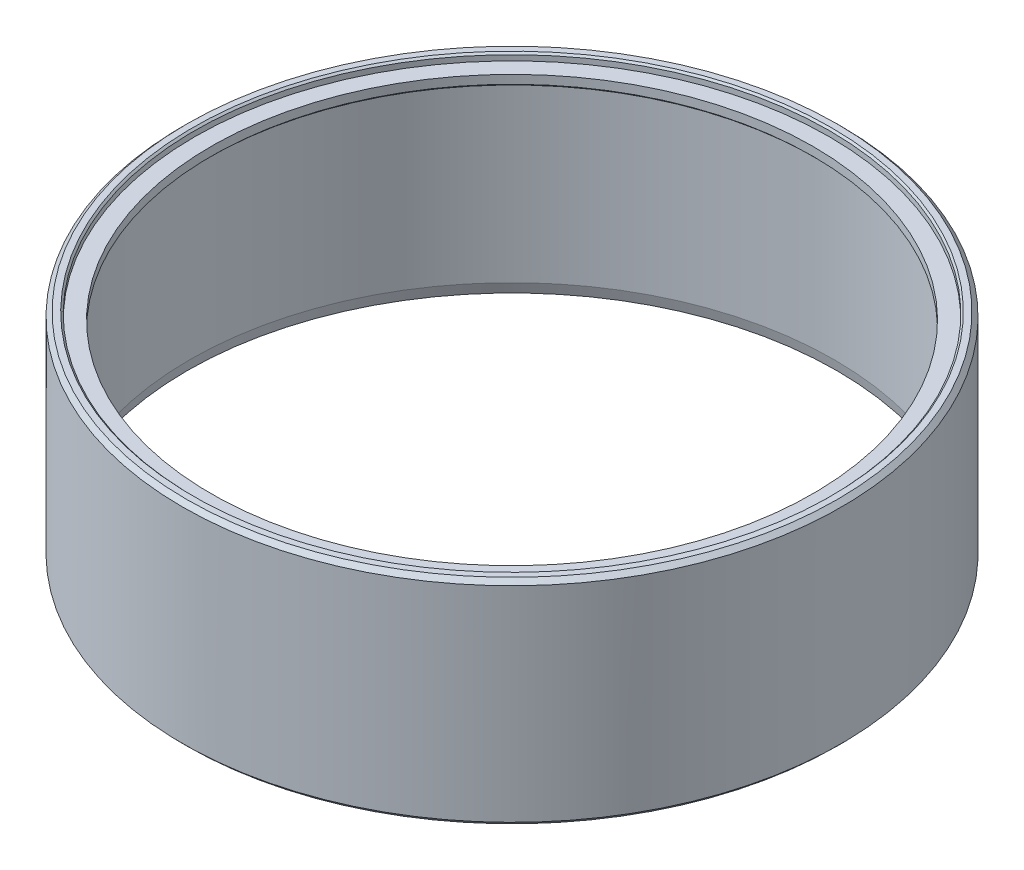
ISO-10303-21;
HEADER;
FILE_DESCRIPTION(('STEP AP214'),'2;1');
FILE_NAME('part.step','',(''),(''),'','','');
FILE_SCHEMA(('AUTOMOTIVE_DESIGN { 1 0 10303 214 1 1 1 1 }'));
ENDSEC;
DATA;
#1=APPLICATION_CONTEXT('core data for automotive mechanical design processes');
#2=APPLICATION_PROTOCOL_DEFINITION('international standard','automotive_design',2000,#1);
#3=PRODUCT_CONTEXT('',#1,'mechanical');
#4=PRODUCT('Part','Part','',(#3));
#5=PRODUCT_RELATED_PRODUCT_CATEGORY('part','',(#4));
#6=PRODUCT_DEFINITION_FORMATION('','',#4);
#7=PRODUCT_DEFINITION_CONTEXT('part definition',#1,'design');
#8=PRODUCT_DEFINITION('design','',#6,#7);
#9=PRODUCT_DEFINITION_SHAPE('','',#8);
#10=(LENGTH_UNIT() NAMED_UNIT(*) SI_UNIT(.MILLI.,.METRE.));
#11=(NAMED_UNIT(*) PLANE_ANGLE_UNIT() SI_UNIT($,.RADIAN.));
#12=(NAMED_UNIT(*) SI_UNIT($,.STERADIAN.) SOLID_ANGLE_UNIT());
#13=UNCERTAINTY_MEASURE_WITH_UNIT(LENGTH_MEASURE(1.E-05),#10,'distance_accuracy_value','');
#14=(GEOMETRIC_REPRESENTATION_CONTEXT(3) GLOBAL_UNCERTAINTY_ASSIGNED_CONTEXT((#13)) GLOBAL_UNIT_ASSIGNED_CONTEXT((#10,
#11,#12)) REPRESENTATION_CONTEXT('',''));
#15=CARTESIAN_POINT('',(0.,0.,0.));
#16=DIRECTION('',(0.,0.,1.));
#17=DIRECTION('',(1.,0.,0.));
#18=AXIS2_PLACEMENT_3D('',#15,#16,#17);
#19=CARTESIAN_POINT('',(0.,7.5,284.8));
#20=DIRECTION('',(0.,-1.,0.));
#21=DIRECTION('',(1.,0.,0.));
#22=AXIS2_PLACEMENT_3D('',#19,#20,#21);
#23=PLANE('',#22);
#24=CARTESIAN_POINT('',(0.,7.5,284.8));
#25=DIRECTION('',(0.,1.,0.));
#26=DIRECTION('',(0.,0.,1.));
#27=AXIS2_PLACEMENT_3D('',#24,#25,#26);
#28=CIRCLE('',#27,42.3);
#29=CARTESIAN_POINT('',(0.,7.5,327.1));
#30=VERTEX_POINT('',#29);
#31=EDGE_CURVE('E93',#30,#30,#28,.T.);
#32=ORIENTED_EDGE('',*,*,#31,.T.);
#33=EDGE_LOOP('',(#32));
#34=FACE_BOUND('',#33,.T.);
#35=CARTESIAN_POINT('',(0.,7.5,284.8));
#36=DIRECTION('',(0.,-1.,0.));
#37=DIRECTION('',(0.,0.,1.));
#38=AXIS2_PLACEMENT_3D('',#35,#36,#37);
#39=CIRCLE('',#38,44.25);
#40=CARTESIAN_POINT('',(0.,7.5,329.05));
#41=VERTEX_POINT('',#40);
#42=EDGE_CURVE('E111',#41,#41,#39,.T.);
#43=ORIENTED_EDGE('',*,*,#42,.T.);
#44=EDGE_LOOP('',(#43));
#45=FACE_BOUND('',#44,.T.);
#46=ADVANCED_FACE('F17',(#34,#45),#23,.T.);
#47=CARTESIAN_POINT('',(0.,9.,284.8));
#48=DIRECTION('',(0.,-1.,0.));
#49=DIRECTION('',(1.,0.,0.));
#50=AXIS2_PLACEMENT_3D('',#47,#48,#49);
#51=PLANE('',#50);
#52=CARTESIAN_POINT('',(0.,9.,284.8));
#53=DIRECTION('',(0.,-1.,0.));
#54=DIRECTION('',(0.,0.,1.));
#55=AXIS2_PLACEMENT_3D('',#52,#53,#54);
#56=CIRCLE('',#55,42.);
#57=CARTESIAN_POINT('',(0.,9.,242.8));
#58=VERTEX_POINT('',#57);
#59=EDGE_CURVE('E21',#58,#58,#56,.T.);
#60=ORIENTED_EDGE('',*,*,#59,.T.);
#61=EDGE_LOOP('',(#60));
#62=FACE_BOUND('',#61,.T.);
#63=CARTESIAN_POINT('',(0.,9.,284.8));
#64=DIRECTION('',(0.,-1.,0.));
#65=DIRECTION('',(0.,0.,1.));
#66=AXIS2_PLACEMENT_3D('',#63,#64,#65);
#67=CIRCLE('',#66,44.3);
#68=CARTESIAN_POINT('',(0.,9.,329.1));
#69=VERTEX_POINT('',#68);
#70=EDGE_CURVE('E115',#69,#69,#67,.T.);
#71=ORIENTED_EDGE('',*,*,#70,.F.);
#72=EDGE_LOOP('',(#71));
#73=FACE_BOUND('',#72,.T.);
#74=ADVANCED_FACE('F171',(#62,#73),#51,.F.);
#75=CARTESIAN_POINT('',(0.,10.,284.8));
#76=DIRECTION('',(0.,-1.,0.));
#77=DIRECTION('',(1.,0.,0.));
#78=AXIS2_PLACEMENT_3D('',#75,#76,#77);
#79=PLANE('',#78);
#80=CARTESIAN_POINT('',(0.,10.,284.8));
#81=DIRECTION('',(0.,-1.,0.));
#82=DIRECTION('',(0.,0.,1.));
#83=AXIS2_PLACEMENT_3D('',#80,#81,#82);
#84=CIRCLE('',#83,44.55);
#85=CARTESIAN_POINT('',(0.,10.,240.25));
#86=VERTEX_POINT('',#85);
#87=EDGE_CURVE('E104',#86,#86,#84,.T.);
#88=ORIENTED_EDGE('',*,*,#87,.T.);
#89=EDGE_LOOP('',(#88));
#90=FACE_BOUND('',#89,.T.);
#91=CARTESIAN_POINT('',(0.,10.,284.8));
#92=DIRECTION('',(0.,1.,0.));
#93=DIRECTION('',(0.,0.,1.));
#94=AXIS2_PLACEMENT_3D('',#91,#92,#93);
#95=CIRCLE('',#94,45.4);
#96=CARTESIAN_POINT('',(0.,10.,330.2));
#97=VERTEX_POINT('',#96);
#98=EDGE_CURVE('E112',#97,#97,#95,.T.);
#99=ORIENTED_EDGE('',*,*,#98,.T.);
#100=EDGE_LOOP('',(#99));
#101=FACE_BOUND('',#100,.T.);
#102=ADVANCED_FACE('F176',(#90,#101),#79,.F.);
#103=CARTESIAN_POINT('',(0.,-19.8,284.8));
#104=DIRECTION('',(0.,-1.,0.));
#105=DIRECTION('',(1.,0.,0.));
#106=AXIS2_PLACEMENT_3D('',#103,#104,#105);
#107=PLANE('',#106);
#108=CARTESIAN_POINT('',(0.,-19.8,284.8));
#109=DIRECTION('',(0.,1.,0.));
#110=DIRECTION('',(0.,0.,-1.));
#111=AXIS2_PLACEMENT_3D('',#108,#109,#110);
#112=CIRCLE('',#111,45.35);
#113=CARTESIAN_POINT('',(0.,-19.8,330.15));
#114=VERTEX_POINT('',#113);
#115=EDGE_CURVE('E138',#114,#114,#112,.T.);
#116=ORIENTED_EDGE('',*,*,#115,.T.);
#117=EDGE_LOOP('',(#116));
#118=FACE_BOUND('',#117,.T.);
#119=CARTESIAN_POINT('',(0.,-19.8,284.8));
#120=DIRECTION('',(0.,-1.,0.));
#121=DIRECTION('',(0.,0.,1.));
#122=AXIS2_PLACEMENT_3D('',#119,#120,#121);
#123=CIRCLE('',#122,45.4);
#124=CARTESIAN_POINT('',(0.,-19.8,239.4));
#125=VERTEX_POINT('',#124);
#126=EDGE_CURVE('E28',#125,#125,#123,.T.);
#127=ORIENTED_EDGE('',*,*,#126,.T.);
#128=EDGE_LOOP('',(#127));
#129=FACE_BOUND('',#128,.T.);
#130=ADVANCED_FACE('F150',(#118,#129),#107,.T.);
#131=CARTESIAN_POINT('',(0.,-19.8,284.8));
#132=DIRECTION('',(0.,1.,0.));
#133=DIRECTION('',(0.,0.,-1.));
#134=AXIS2_PLACEMENT_3D('',#131,#132,#133);
#135=CYLINDRICAL_SURFACE('',#134,45.);
#136=CARTESIAN_POINT('',(0.,6.75,284.8));
#137=DIRECTION('',(0.,1.,0.));
#138=DIRECTION('',(0.,0.,1.));
#139=AXIS2_PLACEMENT_3D('',#136,#137,#138);
#140=CIRCLE('',#139,45.);
#141=CARTESIAN_POINT('',(0.,6.75,329.8));
#142=VERTEX_POINT('',#141);
#143=EDGE_CURVE('E107',#142,#142,#140,.T.);
#144=ORIENTED_EDGE('',*,*,#143,.T.);
#145=EDGE_LOOP('',(#144));
#146=FACE_BOUND('',#145,.T.);
#147=CARTESIAN_POINT('',(0.,-18.3,284.8));
#148=DIRECTION('',(0.,1.,0.));
#149=DIRECTION('',(0.,0.,-1.));
#150=AXIS2_PLACEMENT_3D('',#147,#148,#149);
#151=CIRCLE('',#150,45.);
#152=CARTESIAN_POINT('',(0.,-18.3,239.8));
#153=VERTEX_POINT('',#152);
#154=EDGE_CURVE('E141',#153,#153,#151,.T.);
#155=ORIENTED_EDGE('',*,*,#154,.F.);
#156=EDGE_LOOP('',(#155));
#157=FACE_BOUND('',#156,.T.);
#158=ADVANCED_FACE('F19',(#146,#157),#135,.F.);
#159=CARTESIAN_POINT('',(0.,-19.8,284.8));
#160=DIRECTION('',(0.,1.,0.));
#161=DIRECTION('',(0.,0.,-1.));
#162=AXIS2_PLACEMENT_3D('',#159,#160,#161);
#163=CYLINDRICAL_SURFACE('',#162,46.);
#164=CARTESIAN_POINT('',(0.,9.4,284.8));
#165=DIRECTION('',(0.,-1.,0.));
#166=DIRECTION('',(0.,0.,1.));
#167=AXIS2_PLACEMENT_3D('',#164,#165,#166);
#168=CIRCLE('',#167,46.);
#169=CARTESIAN_POINT('',(0.,9.4,330.8));
#170=VERTEX_POINT('',#169);
#171=EDGE_CURVE('E114',#170,#170,#168,.T.);
#172=ORIENTED_EDGE('',*,*,#171,.T.);
#173=EDGE_LOOP('',(#172));
#174=FACE_BOUND('',#173,.T.);
#175=CARTESIAN_POINT('',(0.,-19.2,284.8));
#176=DIRECTION('',(0.,1.,0.));
#177=DIRECTION('',(0.,0.,1.));
#178=AXIS2_PLACEMENT_3D('',#175,#176,#177);
#179=CIRCLE('',#178,46.);
#180=CARTESIAN_POINT('',(0.,-19.2,238.8));
#181=VERTEX_POINT('',#180);
#182=EDGE_CURVE('E11',#181,#181,#179,.T.);
#183=ORIENTED_EDGE('',*,*,#182,.T.);
#184=EDGE_LOOP('',(#183));
#185=FACE_BOUND('',#184,.T.);
#186=ADVANCED_FACE('F155',(#174,#185),#163,.T.);
#187=CARTESIAN_POINT('',(0.,-19.8,284.8));
#188=DIRECTION('',(0.,1.,0.));
#189=DIRECTION('',(0.,0.,-1.));
#190=AXIS2_PLACEMENT_3D('',#187,#188,#189);
#191=CONICAL_SURFACE('',#190,45.4,0.785398163397454);
#192=ORIENTED_EDGE('',*,*,#182,.F.);
#193=EDGE_LOOP('',(#192));
#194=FACE_BOUND('',#193,.T.);
#195=ORIENTED_EDGE('',*,*,#126,.F.);
#196=EDGE_LOOP('',(#195));
#197=FACE_BOUND('',#196,.T.);
#198=ADVANCED_FACE('F152',(#194,#197),#191,.T.);
#199=CARTESIAN_POINT('',(0.,9.4,284.8));
#200=DIRECTION('',(0.,-1.,0.));
#201=DIRECTION('',(0.,0.,1.));
#202=AXIS2_PLACEMENT_3D('',#199,#200,#201);
#203=CONICAL_SURFACE('',#202,46.,0.78539816339746);
#204=ORIENTED_EDGE('',*,*,#171,.F.);
#205=EDGE_LOOP('',(#204));
#206=FACE_BOUND('',#205,.T.);
#207=ORIENTED_EDGE('',*,*,#98,.F.);
#208=EDGE_LOOP('',(#207));
#209=FACE_BOUND('',#208,.T.);
#210=ADVANCED_FACE('F154',(#206,#209),#203,.T.);
#211=CARTESIAN_POINT('',(0.,9.,284.8));
#212=DIRECTION('',(0.,1.,0.));
#213=DIRECTION('',(0.,0.,-1.));
#214=AXIS2_PLACEMENT_3D('',#211,#212,#213);
#215=CYLINDRICAL_SURFACE('',#214,44.3);
#216=CARTESIAN_POINT('',(0.,9.75,284.8));
#217=DIRECTION('',(0.,1.,0.));
#218=DIRECTION('',(0.,0.,1.));
#219=AXIS2_PLACEMENT_3D('',#216,#217,#218);
#220=CIRCLE('',#219,44.3);
#221=CARTESIAN_POINT('',(0.,9.75,240.5));
#222=VERTEX_POINT('',#221);
#223=EDGE_CURVE('E97',#222,#222,#220,.T.);
#224=ORIENTED_EDGE('',*,*,#223,.T.);
#225=EDGE_LOOP('',(#224));
#226=FACE_BOUND('',#225,.T.);
#227=ORIENTED_EDGE('',*,*,#70,.T.);
#228=EDGE_LOOP('',(#227));
#229=FACE_BOUND('',#228,.T.);
#230=ADVANCED_FACE('F163',(#226,#229),#215,.F.);
#231=CARTESIAN_POINT('',(0.,7.5,284.8));
#232=DIRECTION('',(0.,1.,0.));
#233=DIRECTION('',(0.,0.,-1.));
#234=AXIS2_PLACEMENT_3D('',#231,#232,#233);
#235=CYLINDRICAL_SURFACE('',#234,42.);
#236=ORIENTED_EDGE('',*,*,#59,.F.);
#237=EDGE_LOOP('',(#236));
#238=FACE_BOUND('',#237,.T.);
#239=CARTESIAN_POINT('',(0.,7.8,284.8));
#240=DIRECTION('',(0.,-1.,0.));
#241=DIRECTION('',(0.,0.,1.));
#242=AXIS2_PLACEMENT_3D('',#239,#240,#241);
#243=CIRCLE('',#242,42.);
#244=CARTESIAN_POINT('',(0.,7.8,326.8));
#245=VERTEX_POINT('',#244);
#246=EDGE_CURVE('E85',#245,#245,#243,.T.);
#247=ORIENTED_EDGE('',*,*,#246,.T.);
#248=EDGE_LOOP('',(#247));
#249=FACE_BOUND('',#248,.T.);
#250=ADVANCED_FACE('F189',(#238,#249),#235,.F.);
#251=CARTESIAN_POINT('',(0.,10.,284.8));
#252=DIRECTION('',(0.,1.,0.));
#253=DIRECTION('',(0.,0.,-1.));
#254=AXIS2_PLACEMENT_3D('',#251,#252,#253);
#255=CONICAL_SURFACE('',#254,44.55,0.785398163397435);
#256=ORIENTED_EDGE('',*,*,#87,.F.);
#257=EDGE_LOOP('',(#256));
#258=FACE_BOUND('',#257,.T.);
#259=ORIENTED_EDGE('',*,*,#223,.F.);
#260=EDGE_LOOP('',(#259));
#261=FACE_BOUND('',#260,.T.);
#262=ADVANCED_FACE('F186',(#258,#261),#255,.F.);
#263=CARTESIAN_POINT('',(0.,7.8,284.8));
#264=DIRECTION('',(0.,-1.,0.));
#265=DIRECTION('',(0.,0.,1.));
#266=AXIS2_PLACEMENT_3D('',#263,#264,#265);
#267=CONICAL_SURFACE('',#266,42.,0.785398163397472);
#268=ORIENTED_EDGE('',*,*,#31,.F.);
#269=EDGE_LOOP('',(#268));
#270=FACE_BOUND('',#269,.T.);
#271=ORIENTED_EDGE('',*,*,#246,.F.);
#272=EDGE_LOOP('',(#271));
#273=FACE_BOUND('',#272,.T.);
#274=ADVANCED_FACE('F188',(#270,#273),#267,.F.);
#275=CARTESIAN_POINT('',(0.,7.5,284.8));
#276=DIRECTION('',(0.,-1.,0.));
#277=DIRECTION('',(0.,0.,1.));
#278=AXIS2_PLACEMENT_3D('',#275,#276,#277);
#279=CONICAL_SURFACE('',#278,44.25,0.785398163397448);
#280=ORIENTED_EDGE('',*,*,#143,.F.);
#281=EDGE_LOOP('',(#280));
#282=FACE_BOUND('',#281,.T.);
#283=ORIENTED_EDGE('',*,*,#42,.F.);
#284=EDGE_LOOP('',(#283));
#285=FACE_BOUND('',#284,.T.);
#286=ADVANCED_FACE('F183',(#282,#285),#279,.F.);
#287=CARTESIAN_POINT('',(0.,-19.8,284.8));
#288=DIRECTION('',(0.,-1.,0.));
#289=DIRECTION('',(0.,0.,1.));
#290=AXIS2_PLACEMENT_3D('',#287,#288,#289);
#291=CONICAL_SURFACE('',#290,45.35,0.229231933276997);
#292=ORIENTED_EDGE('',*,*,#115,.F.);
#293=EDGE_LOOP('',(#292));
#294=FACE_BOUND('',#293,.T.);
#295=ORIENTED_EDGE('',*,*,#154,.T.);
#296=EDGE_LOOP('',(#295));
#297=FACE_BOUND('',#296,.T.);
#298=ADVANCED_FACE('F181',(#294,#297),#291,.F.);
#299=CLOSED_SHELL('',(#46,#74,#102,#130,#158,#186,#198,#210,#230,#250,#262,#274,#286,#298));
#300=MANIFOLD_SOLID_BREP('B1',#299);
#301=ADVANCED_BREP_SHAPE_REPRESENTATION('',(#18,#300),#14);
#302=SHAPE_DEFINITION_REPRESENTATION(#9,#301);
ENDSEC;
END-ISO-10303-21;
